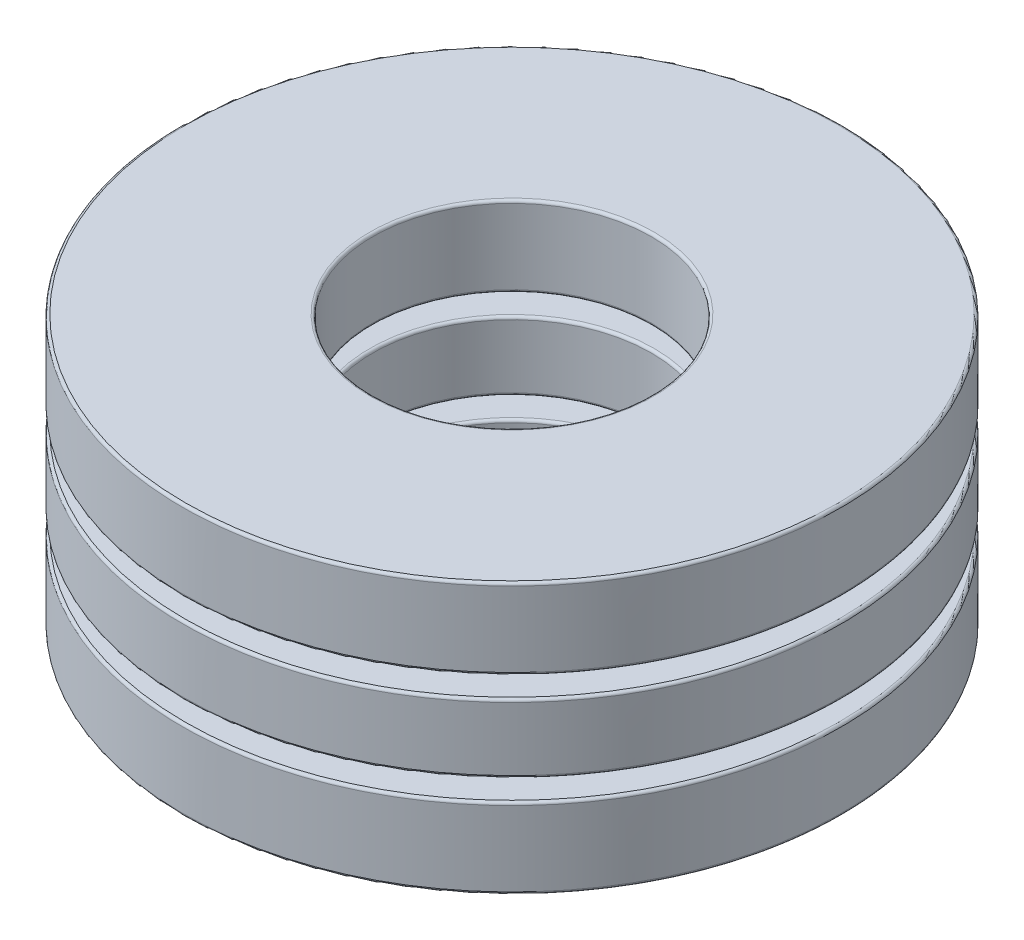
ISO-10303-21;
HEADER;
FILE_DESCRIPTION(('STEP AP214'),'2;1');
FILE_NAME('part.step','',(''),(''),'','','');
FILE_SCHEMA(('AUTOMOTIVE_DESIGN { 1 0 10303 214 1 1 1 1 }'));
ENDSEC;
DATA;
#1=APPLICATION_CONTEXT('core data for automotive mechanical design processes');
#2=APPLICATION_PROTOCOL_DEFINITION('international standard','automotive_design',2000,#1);
#3=PRODUCT_CONTEXT('',#1,'mechanical');
#4=PRODUCT('Part','Part','',(#3));
#5=PRODUCT_RELATED_PRODUCT_CATEGORY('part','',(#4));
#6=PRODUCT_DEFINITION_FORMATION('','',#4);
#7=PRODUCT_DEFINITION_CONTEXT('part definition',#1,'design');
#8=PRODUCT_DEFINITION('design','',#6,#7);
#9=PRODUCT_DEFINITION_SHAPE('','',#8);
#10=(LENGTH_UNIT() NAMED_UNIT(*) SI_UNIT(.MILLI.,.METRE.));
#11=(NAMED_UNIT(*) PLANE_ANGLE_UNIT() SI_UNIT($,.RADIAN.));
#12=(NAMED_UNIT(*) SI_UNIT($,.STERADIAN.) SOLID_ANGLE_UNIT());
#13=UNCERTAINTY_MEASURE_WITH_UNIT(LENGTH_MEASURE(1.E-05),#10,'distance_accuracy_value','');
#14=(GEOMETRIC_REPRESENTATION_CONTEXT(3) GLOBAL_UNCERTAINTY_ASSIGNED_CONTEXT((#13)) GLOBAL_UNIT_ASSIGNED_CONTEXT((#10,
#11,#12)) REPRESENTATION_CONTEXT('',''));
#15=CARTESIAN_POINT('',(0.,0.,0.));
#16=DIRECTION('',(0.,0.,1.));
#17=DIRECTION('',(1.,0.,0.));
#18=AXIS2_PLACEMENT_3D('',#15,#16,#17);
#19=CARTESIAN_POINT('',(0.,-2.46000000000002,0.));
#20=DIRECTION('',(0.,-1.,0.));
#21=DIRECTION('',(0.,0.,-1.));
#22=AXIS2_PLACEMENT_3D('',#19,#20,#21);
#23=CYLINDRICAL_SURFACE('',#22,6.);
#24=CARTESIAN_POINT('',(0.,-2.41079999999999,0.));
#25=DIRECTION('',(0.,1.,0.));
#26=DIRECTION('',(0.,0.,1.));
#27=AXIS2_PLACEMENT_3D('',#24,#25,#26);
#28=CIRCLE('',#27,6.);
#29=CARTESIAN_POINT('',(0.,-2.41079999999999,6.00000000000001));
#30=VERTEX_POINT('',#29);
#31=EDGE_CURVE('E11',#30,#30,#28,.T.);
#32=ORIENTED_EDGE('',*,*,#31,.T.);
#33=EDGE_LOOP('',(#32));
#34=FACE_BOUND('',#33,.T.);
#35=CARTESIAN_POINT('',(0.,-1.04919999999997,0.));
#36=DIRECTION('',(0.,-1.,0.));
#37=DIRECTION('',(0.,0.,-1.));
#38=AXIS2_PLACEMENT_3D('',#35,#36,#37);
#39=CIRCLE('',#38,6.);
#40=CARTESIAN_POINT('',(0.,-1.04919999999997,-6.00000000000001));
#41=VERTEX_POINT('',#40);
#42=EDGE_CURVE('E52',#41,#41,#39,.T.);
#43=ORIENTED_EDGE('',*,*,#42,.T.);
#44=EDGE_LOOP('',(#43));
#45=FACE_BOUND('',#44,.T.);
#46=ADVANCED_FACE('F45',(#34,#45),#23,.T.);
#47=CARTESIAN_POINT('',(2.22044604925031E-13,-1.00000000000011,6.00000000000012));
#48=DIRECTION('',(0.,-1.,0.));
#49=DIRECTION('',(0.,0.,-1.));
#50=AXIS2_PLACEMENT_3D('',#47,#48,#49);
#51=PLANE('',#50);
#52=CARTESIAN_POINT('',(0.,-1.,0.));
#53=DIRECTION('',(0.,-1.,0.));
#54=DIRECTION('',(0.,0.,-1.));
#55=AXIS2_PLACEMENT_3D('',#52,#53,#54);
#56=CIRCLE('',#55,2.5872);
#57=CARTESIAN_POINT('',(0.,-1.,-2.5872));
#58=VERTEX_POINT('',#57);
#59=EDGE_CURVE('E56',#58,#58,#56,.T.);
#60=ORIENTED_EDGE('',*,*,#59,.T.);
#61=EDGE_LOOP('',(#60));
#62=FACE_BOUND('',#61,.T.);
#63=CARTESIAN_POINT('',(0.,-1.,0.));
#64=DIRECTION('',(0.,-1.,0.));
#65=DIRECTION('',(0.,0.,-1.));
#66=AXIS2_PLACEMENT_3D('',#63,#64,#65);
#67=CIRCLE('',#66,5.9508);
#68=CARTESIAN_POINT('',(0.,-1.,-5.95080000000001));
#69=VERTEX_POINT('',#68);
#70=EDGE_CURVE('E60',#69,#69,#67,.F.);
#71=ORIENTED_EDGE('',*,*,#70,.T.);
#72=EDGE_LOOP('',(#71));
#73=FACE_BOUND('',#72,.T.);
#74=ADVANCED_FACE('F88',(#62,#73),#51,.F.);
#75=CARTESIAN_POINT('',(0.,-2.46000000000002,0.));
#76=DIRECTION('',(0.,-1.,0.));
#77=DIRECTION('',(0.,0.,-1.));
#78=AXIS2_PLACEMENT_3D('',#75,#76,#77);
#79=CYLINDRICAL_SURFACE('',#78,2.538);
#80=CARTESIAN_POINT('',(0.,-2.41079999999999,0.));
#81=DIRECTION('',(0.,1.,0.));
#82=DIRECTION('',(0.,0.,1.));
#83=AXIS2_PLACEMENT_3D('',#80,#81,#82);
#84=CIRCLE('',#83,2.538);
#85=CARTESIAN_POINT('',(0.,-2.41079999999999,2.538));
#86=VERTEX_POINT('',#85);
#87=EDGE_CURVE('E71',#86,#86,#84,.F.);
#88=ORIENTED_EDGE('',*,*,#87,.T.);
#89=EDGE_LOOP('',(#88));
#90=FACE_BOUND('',#89,.T.);
#91=CARTESIAN_POINT('',(0.,-1.04919999999997,0.));
#92=DIRECTION('',(0.,-1.,0.));
#93=DIRECTION('',(0.,0.,-1.));
#94=AXIS2_PLACEMENT_3D('',#91,#92,#93);
#95=CIRCLE('',#94,2.538);
#96=CARTESIAN_POINT('',(0.,-1.04919999999997,-2.538));
#97=VERTEX_POINT('',#96);
#98=EDGE_CURVE('E74',#97,#97,#95,.F.);
#99=ORIENTED_EDGE('',*,*,#98,.T.);
#100=EDGE_LOOP('',(#99));
#101=FACE_BOUND('',#100,.T.);
#102=ADVANCED_FACE('F78',(#90,#101),#79,.F.);
#103=CARTESIAN_POINT('',(1.66533453693773E-13,-2.46000000000013,6.00000000000012));
#104=DIRECTION('',(0.,1.,0.));
#105=DIRECTION('',(0.,0.,1.));
#106=AXIS2_PLACEMENT_3D('',#103,#104,#105);
#107=PLANE('',#106);
#108=CARTESIAN_POINT('',(0.,-2.46000000000002,0.));
#109=DIRECTION('',(0.,1.,0.));
#110=DIRECTION('',(0.,0.,1.));
#111=AXIS2_PLACEMENT_3D('',#108,#109,#110);
#112=CIRCLE('',#111,2.5872);
#113=CARTESIAN_POINT('',(0.,-2.46000000000002,2.5872));
#114=VERTEX_POINT('',#113);
#115=EDGE_CURVE('E65',#114,#114,#112,.T.);
#116=ORIENTED_EDGE('',*,*,#115,.T.);
#117=EDGE_LOOP('',(#116));
#118=FACE_BOUND('',#117,.T.);
#119=CARTESIAN_POINT('',(0.,-2.46000000000002,0.));
#120=DIRECTION('',(0.,1.,0.));
#121=DIRECTION('',(0.,0.,1.));
#122=AXIS2_PLACEMENT_3D('',#119,#120,#121);
#123=CIRCLE('',#122,5.9508);
#124=CARTESIAN_POINT('',(0.,-2.46000000000002,5.95080000000001));
#125=VERTEX_POINT('',#124);
#126=EDGE_CURVE('E68',#125,#125,#123,.F.);
#127=ORIENTED_EDGE('',*,*,#126,.T.);
#128=EDGE_LOOP('',(#127));
#129=FACE_BOUND('',#128,.T.);
#130=ADVANCED_FACE('F107',(#118,#129),#107,.F.);
#131=CARTESIAN_POINT('',(0.,-2.41079999999999,0.));
#132=DIRECTION('',(0.,1.,0.));
#133=DIRECTION('',(0.,0.,1.));
#134=AXIS2_PLACEMENT_3D('',#131,#132,#133);
#135=TOROIDAL_SURFACE('',#134,2.5872,0.0492);
#136=ORIENTED_EDGE('',*,*,#115,.F.);
#137=EDGE_LOOP('',(#136));
#138=FACE_BOUND('',#137,.T.);
#139=ORIENTED_EDGE('',*,*,#87,.F.);
#140=EDGE_LOOP('',(#139));
#141=FACE_BOUND('',#140,.T.);
#142=ADVANCED_FACE('F84',(#138,#141),#135,.T.);
#143=CARTESIAN_POINT('',(0.,-1.04919999999997,0.));
#144=DIRECTION('',(0.,-1.,0.));
#145=DIRECTION('',(0.,0.,-1.));
#146=AXIS2_PLACEMENT_3D('',#143,#144,#145);
#147=TOROIDAL_SURFACE('',#146,2.5872,0.0492);
#148=ORIENTED_EDGE('',*,*,#98,.F.);
#149=EDGE_LOOP('',(#148));
#150=FACE_BOUND('',#149,.T.);
#151=ORIENTED_EDGE('',*,*,#59,.F.);
#152=EDGE_LOOP('',(#151));
#153=FACE_BOUND('',#152,.T.);
#154=ADVANCED_FACE('F80',(#150,#153),#147,.T.);
#155=CARTESIAN_POINT('',(0.,-2.41079999999999,0.));
#156=DIRECTION('',(0.,1.,0.));
#157=DIRECTION('',(0.,0.,1.));
#158=AXIS2_PLACEMENT_3D('',#155,#156,#157);
#159=TOROIDAL_SURFACE('',#158,5.9508,0.0492);
#160=ORIENTED_EDGE('',*,*,#31,.F.);
#161=EDGE_LOOP('',(#160));
#162=FACE_BOUND('',#161,.T.);
#163=ORIENTED_EDGE('',*,*,#126,.F.);
#164=EDGE_LOOP('',(#163));
#165=FACE_BOUND('',#164,.T.);
#166=ADVANCED_FACE('F83',(#162,#165),#159,.T.);
#167=CARTESIAN_POINT('',(0.,-1.04919999999997,0.));
#168=DIRECTION('',(0.,-1.,0.));
#169=DIRECTION('',(0.,0.,-1.));
#170=AXIS2_PLACEMENT_3D('',#167,#168,#169);
#171=TOROIDAL_SURFACE('',#170,5.9508,0.0492);
#172=ORIENTED_EDGE('',*,*,#70,.F.);
#173=EDGE_LOOP('',(#172));
#174=FACE_BOUND('',#173,.T.);
#175=ORIENTED_EDGE('',*,*,#42,.F.);
#176=EDGE_LOOP('',(#175));
#177=FACE_BOUND('',#176,.T.);
#178=ADVANCED_FACE('F47',(#174,#177),#171,.T.);
#179=CLOSED_SHELL('',(#46,#74,#102,#130,#142,#154,#166,#178));
#180=MANIFOLD_SOLID_BREP('B2',#179);
#181=CARTESIAN_POINT('',(0.,-2.46000000000002,0.));
#182=DIRECTION('',(0.,-1.,0.));
#183=DIRECTION('',(0.,0.,-1.));
#184=AXIS2_PLACEMENT_3D('',#181,#182,#183);
#185=CYLINDRICAL_SURFACE('',#184,6.);
#186=CARTESIAN_POINT('',(0.,1.04920000000003,0.));
#187=DIRECTION('',(0.,1.,0.));
#188=DIRECTION('',(0.,0.,1.));
#189=AXIS2_PLACEMENT_3D('',#186,#187,#188);
#190=CIRCLE('',#189,6.);
#191=CARTESIAN_POINT('',(0.,1.04920000000003,6.00000000000001));
#192=VERTEX_POINT('',#191);
#193=EDGE_CURVE('E44',#192,#192,#190,.T.);
#194=ORIENTED_EDGE('',*,*,#193,.T.);
#195=EDGE_LOOP('',(#194));
#196=FACE_BOUND('',#195,.T.);
#197=CARTESIAN_POINT('',(0.,2.41079999999999,-2.22044604925031E-13));
#198=DIRECTION('',(0.,-1.,0.));
#199=DIRECTION('',(0.,0.,-1.));
#200=AXIS2_PLACEMENT_3D('',#197,#198,#199);
#201=CIRCLE('',#200,6.);
#202=CARTESIAN_POINT('',(0.,2.41079999999999,-6.00000000000023));
#203=VERTEX_POINT('',#202);
#204=EDGE_CURVE('E179',#203,#203,#201,.T.);
#205=ORIENTED_EDGE('',*,*,#204,.T.);
#206=EDGE_LOOP('',(#205));
#207=FACE_BOUND('',#206,.T.);
#208=ADVANCED_FACE('F172',(#196,#207),#185,.T.);
#209=CARTESIAN_POINT('',(-1.66533453693773E-13,2.45999999999991,5.99999999999978));
#210=DIRECTION('',(0.,-1.,0.));
#211=DIRECTION('',(0.,0.,-1.));
#212=AXIS2_PLACEMENT_3D('',#209,#210,#211);
#213=PLANE('',#212);
#214=CARTESIAN_POINT('',(0.,2.46000000000002,-2.22044604925031E-13));
#215=DIRECTION('',(0.,-1.,0.));
#216=DIRECTION('',(0.,0.,-1.));
#217=AXIS2_PLACEMENT_3D('',#214,#215,#216);
#218=CIRCLE('',#217,2.5872);
#219=CARTESIAN_POINT('',(0.,2.46000000000002,-2.58720000000023));
#220=VERTEX_POINT('',#219);
#221=EDGE_CURVE('E183',#220,#220,#218,.T.);
#222=ORIENTED_EDGE('',*,*,#221,.T.);
#223=EDGE_LOOP('',(#222));
#224=FACE_BOUND('',#223,.T.);
#225=CARTESIAN_POINT('',(0.,2.46000000000002,-2.22044604925031E-13));
#226=DIRECTION('',(0.,-1.,0.));
#227=DIRECTION('',(0.,0.,-1.));
#228=AXIS2_PLACEMENT_3D('',#225,#226,#227);
#229=CIRCLE('',#228,5.9508);
#230=CARTESIAN_POINT('',(0.,2.46000000000002,-5.95080000000023));
#231=VERTEX_POINT('',#230);
#232=EDGE_CURVE('E187',#231,#231,#229,.F.);
#233=ORIENTED_EDGE('',*,*,#232,.T.);
#234=EDGE_LOOP('',(#233));
#235=FACE_BOUND('',#234,.T.);
#236=ADVANCED_FACE('F215',(#224,#235),#213,.F.);
#237=CARTESIAN_POINT('',(0.,-2.46000000000002,0.));
#238=DIRECTION('',(0.,-1.,0.));
#239=DIRECTION('',(0.,0.,-1.));
#240=AXIS2_PLACEMENT_3D('',#237,#238,#239);
#241=CYLINDRICAL_SURFACE('',#240,2.538);
#242=CARTESIAN_POINT('',(0.,1.04920000000003,0.));
#243=DIRECTION('',(0.,1.,0.));
#244=DIRECTION('',(0.,0.,1.));
#245=AXIS2_PLACEMENT_3D('',#242,#243,#244);
#246=CIRCLE('',#245,2.538);
#247=CARTESIAN_POINT('',(0.,1.04920000000003,2.538));
#248=VERTEX_POINT('',#247);
#249=EDGE_CURVE('E198',#248,#248,#246,.F.);
#250=ORIENTED_EDGE('',*,*,#249,.T.);
#251=EDGE_LOOP('',(#250));
#252=FACE_BOUND('',#251,.T.);
#253=CARTESIAN_POINT('',(0.,2.41079999999999,-2.22044604925031E-13));
#254=DIRECTION('',(0.,-1.,0.));
#255=DIRECTION('',(0.,0.,-1.));
#256=AXIS2_PLACEMENT_3D('',#253,#254,#255);
#257=CIRCLE('',#256,2.538);
#258=CARTESIAN_POINT('',(0.,2.41079999999999,-2.53800000000023));
#259=VERTEX_POINT('',#258);
#260=EDGE_CURVE('E201',#259,#259,#257,.F.);
#261=ORIENTED_EDGE('',*,*,#260,.T.);
#262=EDGE_LOOP('',(#261));
#263=FACE_BOUND('',#262,.T.);
#264=ADVANCED_FACE('F205',(#252,#263),#241,.F.);
#265=CARTESIAN_POINT('',(1.11022302462516E-13,0.99999999999989,6.00000000000023));
#266=DIRECTION('',(0.,1.,0.));
#267=DIRECTION('',(0.,0.,1.));
#268=AXIS2_PLACEMENT_3D('',#265,#266,#267);
#269=PLANE('',#268);
#270=CARTESIAN_POINT('',(0.,1.,0.));
#271=DIRECTION('',(0.,1.,0.));
#272=DIRECTION('',(0.,0.,1.));
#273=AXIS2_PLACEMENT_3D('',#270,#271,#272);
#274=CIRCLE('',#273,2.5872);
#275=CARTESIAN_POINT('',(0.,1.,2.5872));
#276=VERTEX_POINT('',#275);
#277=EDGE_CURVE('E192',#276,#276,#274,.T.);
#278=ORIENTED_EDGE('',*,*,#277,.T.);
#279=EDGE_LOOP('',(#278));
#280=FACE_BOUND('',#279,.T.);
#281=CARTESIAN_POINT('',(0.,1.,0.));
#282=DIRECTION('',(0.,1.,0.));
#283=DIRECTION('',(0.,0.,1.));
#284=AXIS2_PLACEMENT_3D('',#281,#282,#283);
#285=CIRCLE('',#284,5.9508);
#286=CARTESIAN_POINT('',(0.,1.,5.95080000000001));
#287=VERTEX_POINT('',#286);
#288=EDGE_CURVE('E195',#287,#287,#285,.F.);
#289=ORIENTED_EDGE('',*,*,#288,.T.);
#290=EDGE_LOOP('',(#289));
#291=FACE_BOUND('',#290,.T.);
#292=ADVANCED_FACE('F234',(#280,#291),#269,.F.);
#293=CARTESIAN_POINT('',(0.,1.04920000000003,0.));
#294=DIRECTION('',(0.,1.,0.));
#295=DIRECTION('',(0.,0.,1.));
#296=AXIS2_PLACEMENT_3D('',#293,#294,#295);
#297=TOROIDAL_SURFACE('',#296,2.5872,0.0492);
#298=ORIENTED_EDGE('',*,*,#277,.F.);
#299=EDGE_LOOP('',(#298));
#300=FACE_BOUND('',#299,.T.);
#301=ORIENTED_EDGE('',*,*,#249,.F.);
#302=EDGE_LOOP('',(#301));
#303=FACE_BOUND('',#302,.T.);
#304=ADVANCED_FACE('F211',(#300,#303),#297,.T.);
#305=CARTESIAN_POINT('',(0.,2.41079999999999,-2.22044604925031E-13));
#306=DIRECTION('',(0.,-1.,0.));
#307=DIRECTION('',(0.,0.,-1.));
#308=AXIS2_PLACEMENT_3D('',#305,#306,#307);
#309=TOROIDAL_SURFACE('',#308,2.5872,0.0492);
#310=ORIENTED_EDGE('',*,*,#260,.F.);
#311=EDGE_LOOP('',(#310));
#312=FACE_BOUND('',#311,.T.);
#313=ORIENTED_EDGE('',*,*,#221,.F.);
#314=EDGE_LOOP('',(#313));
#315=FACE_BOUND('',#314,.T.);
#316=ADVANCED_FACE('F207',(#312,#315),#309,.T.);
#317=CARTESIAN_POINT('',(0.,1.04920000000003,0.));
#318=DIRECTION('',(0.,1.,0.));
#319=DIRECTION('',(0.,0.,1.));
#320=AXIS2_PLACEMENT_3D('',#317,#318,#319);
#321=TOROIDAL_SURFACE('',#320,5.9508,0.0492);
#322=ORIENTED_EDGE('',*,*,#193,.F.);
#323=EDGE_LOOP('',(#322));
#324=FACE_BOUND('',#323,.T.);
#325=ORIENTED_EDGE('',*,*,#288,.F.);
#326=EDGE_LOOP('',(#325));
#327=FACE_BOUND('',#326,.T.);
#328=ADVANCED_FACE('F210',(#324,#327),#321,.T.);
#329=CARTESIAN_POINT('',(0.,2.41079999999999,-2.22044604925031E-13));
#330=DIRECTION('',(0.,-1.,0.));
#331=DIRECTION('',(0.,0.,-1.));
#332=AXIS2_PLACEMENT_3D('',#329,#330,#331);
#333=TOROIDAL_SURFACE('',#332,5.9508,0.0492);
#334=ORIENTED_EDGE('',*,*,#232,.F.);
#335=EDGE_LOOP('',(#334));
#336=FACE_BOUND('',#335,.T.);
#337=ORIENTED_EDGE('',*,*,#204,.F.);
#338=EDGE_LOOP('',(#337));
#339=FACE_BOUND('',#338,.T.);
#340=ADVANCED_FACE('F174',(#336,#339),#333,.T.);
#341=CLOSED_SHELL('',(#208,#236,#264,#292,#304,#316,#328,#340));
#342=MANIFOLD_SOLID_BREP('B6',#341);
#343=CARTESIAN_POINT('',(-3.51824167110602,-1.11022302462516E-13,2.80570410836445));
#344=DIRECTION('',(0.,1.,0.));
#345=DIRECTION('',(0.781831482468023,0.,-0.623489801858743));
#346=AXIS2_PLACEMENT_3D('',#343,#344,#345);
#347=SPHERICAL_SURFACE('',#346,1.);
#348=CARTESIAN_POINT('',(-3.51824167110602,0.999999999999889,2.80570410836445));
#349=VERTEX_POINT('',#348);
#350=VERTEX_LOOP('',#349);
#351=FACE_BOUND('',#350,.T.);
#352=ADVANCED_FACE('F299',(#351),#347,.T.);
#353=CLOSED_SHELL('',(#352));
#354=MANIFOLD_SOLID_BREP('B39',#353);
#355=CARTESIAN_POINT('',(-4.38717560481816,-1.11022302462516E-13,-1.00134420280357));
#356=DIRECTION('',(0.,1.,0.));
#357=DIRECTION('',(0.974927912181827,0.,0.222520933956306));
#358=AXIS2_PLACEMENT_3D('',#355,#356,#357);
#359=SPHERICAL_SURFACE('',#358,1.);
#360=CARTESIAN_POINT('',(-4.38717560481816,0.999999999999889,-1.00134420280357));
#361=VERTEX_POINT('',#360);
#362=VERTEX_LOOP('',#361);
#363=FACE_BOUND('',#362,.T.);
#364=ADVANCED_FACE('F317',(#363),#359,.T.);
#365=CLOSED_SHELL('',(#364));
#366=MANIFOLD_SOLID_BREP('B168',#365);
#367=CARTESIAN_POINT('',(-1.95247682602906,-1.11022302462516E-13,-4.05435990556102));
#368=DIRECTION('',(0.,1.,0.));
#369=DIRECTION('',(0.433883739117565,0.,0.900968867902417));
#370=AXIS2_PLACEMENT_3D('',#367,#368,#369);
#371=SPHERICAL_SURFACE('',#370,1.);
#372=CARTESIAN_POINT('',(-1.95247682602906,0.999999999999889,-4.05435990556102));
#373=VERTEX_POINT('',#372);
#374=VERTEX_LOOP('',#373);
#375=FACE_BOUND('',#374,.T.);
#376=ADVANCED_FACE('F335',(#375),#371,.T.);
#377=CLOSED_SHELL('',(#376));
#378=MANIFOLD_SOLID_BREP('B295',#377);
#379=CARTESIAN_POINT('',(1.95247682602911,0.,-4.05435990556102));
#380=DIRECTION('',(0.,1.,0.));
#381=DIRECTION('',(-0.433883739117553,0.,0.900968867902423));
#382=AXIS2_PLACEMENT_3D('',#379,#380,#381);
#383=SPHERICAL_SURFACE('',#382,1.);
#384=CARTESIAN_POINT('',(1.95247682602911,1.,-4.05435990556102));
#385=VERTEX_POINT('',#384);
#386=VERTEX_LOOP('',#385);
#387=FACE_BOUND('',#386,.T.);
#388=ADVANCED_FACE('F353',(#387),#383,.T.);
#389=CLOSED_SHELL('',(#388));
#390=MANIFOLD_SOLID_BREP('B313',#389);
#391=CARTESIAN_POINT('',(4.38717560481824,0.,-1.00134420280368));
#392=DIRECTION('',(0.,1.,0.));
#393=DIRECTION('',(-0.974927912181824,0.,0.222520933956318));
#394=AXIS2_PLACEMENT_3D('',#391,#392,#393);
#395=SPHERICAL_SURFACE('',#394,1.);
#396=CARTESIAN_POINT('',(4.38717560481824,1.,-1.00134420280368));
#397=VERTEX_POINT('',#396);
#398=VERTEX_LOOP('',#397);
#399=FACE_BOUND('',#398,.T.);
#400=ADVANCED_FACE('F371',(#399),#395,.T.);
#401=CLOSED_SHELL('',(#400));
#402=MANIFOLD_SOLID_BREP('B331',#401);
#403=CARTESIAN_POINT('',(3.51824167110627,0.,2.80570410836367));
#404=DIRECTION('',(0.,1.,0.));
#405=DIRECTION('',(-0.781831482468032,0.,-0.623489801858733));
#406=AXIS2_PLACEMENT_3D('',#403,#404,#405);
#407=SPHERICAL_SURFACE('',#406,1.);
#408=CARTESIAN_POINT('',(3.51824167110627,1.,2.80570410836367));
#409=VERTEX_POINT('',#408);
#410=VERTEX_LOOP('',#409);
#411=FACE_BOUND('',#410,.T.);
#412=ADVANCED_FACE('F389',(#411),#407,.T.);
#413=CLOSED_SHELL('',(#412));
#414=MANIFOLD_SOLID_BREP('B349',#413);
#415=CARTESIAN_POINT('',(0.,0.,4.49999999999939));
#416=DIRECTION('',(0.,1.,0.));
#417=DIRECTION('',(0.,0.,-1.));
#418=AXIS2_PLACEMENT_3D('',#415,#416,#417);
#419=SPHERICAL_SURFACE('',#418,1.);
#420=CARTESIAN_POINT('',(0.,1.,4.49999999999939));
#421=VERTEX_POINT('',#420);
#422=VERTEX_LOOP('',#421);
#423=FACE_BOUND('',#422,.T.);
#424=ADVANCED_FACE('F408',(#423),#419,.T.);
#425=CLOSED_SHELL('',(#424));
#426=MANIFOLD_SOLID_BREP('B367',#425);
#427=CARTESIAN_POINT('',(0.,-2.46000000000002,0.));
#428=DIRECTION('',(0.,-1.,0.));
#429=DIRECTION('',(0.,0.,-1.));
#430=AXIS2_PLACEMENT_3D('',#427,#428,#429);
#431=CYLINDRICAL_SURFACE('',#430,6.);
#432=CARTESIAN_POINT('',(0.,-0.575800000000015,0.));
#433=DIRECTION('',(0.,1.,0.));
#434=DIRECTION('',(0.,0.,1.));
#435=AXIS2_PLACEMENT_3D('',#432,#433,#434);
#436=CIRCLE('',#435,6.);
#437=CARTESIAN_POINT('',(0.,-0.575800000000015,6.00000000000001));
#438=VERTEX_POINT('',#437);
#439=EDGE_CURVE('E407',#438,#438,#436,.T.);
#440=ORIENTED_EDGE('',*,*,#439,.T.);
#441=EDGE_LOOP('',(#440));
#442=FACE_BOUND('',#441,.T.);
#443=CARTESIAN_POINT('',(0.,0.575800000000015,-1.11022302462516E-13));
#444=DIRECTION('',(0.,-1.,0.));
#445=DIRECTION('',(0.,0.,-1.));
#446=AXIS2_PLACEMENT_3D('',#443,#444,#445);
#447=CIRCLE('',#446,6.);
#448=CARTESIAN_POINT('',(0.,0.575800000000015,-6.00000000000012));
#449=VERTEX_POINT('',#448);
#450=EDGE_CURVE('E427',#449,#449,#447,.T.);
#451=ORIENTED_EDGE('',*,*,#450,.T.);
#452=EDGE_LOOP('',(#451));
#453=FACE_BOUND('',#452,.T.);
#454=ADVANCED_FACE('F420',(#442,#453),#431,.T.);
#455=CARTESIAN_POINT('',(1.66533453693773E-13,-0.625000000000098,6.00000000000012));
#456=DIRECTION('',(0.,1.,0.));
#457=DIRECTION('',(0.,0.,1.));
#458=AXIS2_PLACEMENT_3D('',#455,#456,#457);
#459=PLANE('',#458);
#460=CARTESIAN_POINT('',(0.,-0.624999999999987,0.));
#461=DIRECTION('',(0.,1.,0.));
#462=DIRECTION('',(0.,0.,1.));
#463=AXIS2_PLACEMENT_3D('',#460,#461,#462);
#464=CIRCLE('',#463,2.5872);
#465=CARTESIAN_POINT('',(0.,-0.624999999999987,2.5872));
#466=VERTEX_POINT('',#465);
#467=EDGE_CURVE('E440',#466,#466,#464,.T.);
#468=ORIENTED_EDGE('',*,*,#467,.T.);
#469=EDGE_LOOP('',(#468));
#470=FACE_BOUND('',#469,.T.);
#471=CARTESIAN_POINT('',(0.,-0.624999999999987,0.));
#472=DIRECTION('',(0.,1.,0.));
#473=DIRECTION('',(0.,0.,1.));
#474=AXIS2_PLACEMENT_3D('',#471,#472,#473);
#475=CIRCLE('',#474,5.9508);
#476=CARTESIAN_POINT('',(0.,-0.624999999999987,5.95080000000001));
#477=VERTEX_POINT('',#476);
#478=EDGE_CURVE('E443',#477,#477,#475,.F.);
#479=ORIENTED_EDGE('',*,*,#478,.T.);
#480=EDGE_LOOP('',(#479));
#481=FACE_BOUND('',#480,.T.);
#482=CARTESIAN_POINT('',(-3.51824167110604,-0.625000000000098,2.80570410836445));
#483=DIRECTION('',(0.,1.,0.));
#484=DIRECTION('',(-0.781831482468023,0.,0.623489801858743));
#485=AXIS2_PLACEMENT_3D('',#482,#483,#484);
#486=CIRCLE('',#485,0.85923294280422);
#487=CARTESIAN_POINT('',(-4.19001703656402,-0.625000000000098,3.34142708562396));
#488=VERTEX_POINT('',#487);
#489=EDGE_CURVE('E488',#488,#488,#486,.T.);
#490=ORIENTED_EDGE('',*,*,#489,.T.);
#491=EDGE_LOOP('',(#490));
#492=FACE_BOUND('',#491,.T.);
#493=CARTESIAN_POINT('',(-4.38717560481813,-0.625000000000098,-1.00134420280362));
#494=DIRECTION('',(0.,1.,0.));
#495=DIRECTION('',(-0.974927912181827,0.,-0.222520933956305));
#496=AXIS2_PLACEMENT_3D('',#493,#494,#495);
#497=CIRCLE('',#496,0.85923294280422);
#498=CARTESIAN_POINT('',(-5.2248657838241,-0.625000000000098,-1.19254151972244));
#499=VERTEX_POINT('',#498);
#500=EDGE_CURVE('E482',#499,#499,#497,.T.);
#501=ORIENTED_EDGE('',*,*,#500,.T.);
#502=EDGE_LOOP('',(#501));
#503=FACE_BOUND('',#502,.T.);
#504=CARTESIAN_POINT('',(-1.95247682602903,-0.625000000000098,-4.05435990556102));
#505=DIRECTION('',(0.,1.,0.));
#506=DIRECTION('',(-0.433883739117566,0.,-0.900968867902417));
#507=AXIS2_PLACEMENT_3D('',#504,#505,#506);
#508=CIRCLE('',#507,0.85923294280422);
#509=CARTESIAN_POINT('',(-2.32528402802592,-0.625000000000098,-4.8285020373038));
#510=VERTEX_POINT('',#509);
#511=EDGE_CURVE('E476',#510,#510,#508,.T.);
#512=ORIENTED_EDGE('',*,*,#511,.T.);
#513=EDGE_LOOP('',(#512));
#514=FACE_BOUND('',#513,.T.);
#515=CARTESIAN_POINT('',(1.95247682602902,-0.624999999999987,-4.05435990556102));
#516=DIRECTION('',(0.,1.,0.));
#517=DIRECTION('',(0.433883739117553,0.,-0.900968867902423));
#518=AXIS2_PLACEMENT_3D('',#515,#516,#517);
#519=CIRCLE('',#518,0.85923294280422);
#520=CARTESIAN_POINT('',(2.32528402802589,-0.624999999999987,-4.82850203730381));
#521=VERTEX_POINT('',#520);
#522=EDGE_CURVE('E470',#521,#521,#519,.T.);
#523=ORIENTED_EDGE('',*,*,#522,.T.);
#524=EDGE_LOOP('',(#523));
#525=FACE_BOUND('',#524,.T.);
#526=CARTESIAN_POINT('',(4.3871756048182,-0.624999999999987,-1.00134420280373));
#527=DIRECTION('',(0.,1.,0.));
#528=DIRECTION('',(0.974927912181825,0.,-0.222520933956319));
#529=AXIS2_PLACEMENT_3D('',#526,#527,#528);
#530=CIRCLE('',#529,0.85923294280422);
#531=CARTESIAN_POINT('',(5.22486578382417,-0.624999999999987,-1.19254151972256));
#532=VERTEX_POINT('',#531);
#533=EDGE_CURVE('E464',#532,#532,#530,.T.);
#534=ORIENTED_EDGE('',*,*,#533,.T.);
#535=EDGE_LOOP('',(#534));
#536=FACE_BOUND('',#535,.T.);
#537=CARTESIAN_POINT('',(3.51824167110627,-0.624999999999987,2.80570410836367));
#538=DIRECTION('',(0.,1.,0.));
#539=DIRECTION('',(0.781831482468032,0.,0.623489801858733));
#540=AXIS2_PLACEMENT_3D('',#537,#538,#539);
#541=CIRCLE('',#540,0.85923294280422);
#542=CARTESIAN_POINT('',(4.19001703656427,-0.624999999999987,3.34142708562317));
#543=VERTEX_POINT('',#542);
#544=EDGE_CURVE('E456',#543,#543,#541,.T.);
#545=ORIENTED_EDGE('',*,*,#544,.T.);
#546=EDGE_LOOP('',(#545));
#547=FACE_BOUND('',#546,.T.);
#548=CARTESIAN_POINT('',(0.,-0.624999999999987,4.4999999999995));
#549=DIRECTION('',(0.,1.,0.));
#550=DIRECTION('',(0.,0.,1.));
#551=AXIS2_PLACEMENT_3D('',#548,#549,#550);
#552=CIRCLE('',#551,0.85923294280422);
#553=CARTESIAN_POINT('',(0.,-0.624999999999987,5.35923294280373));
#554=VERTEX_POINT('',#553);
#555=EDGE_CURVE('E452',#554,#554,#552,.T.);
#556=ORIENTED_EDGE('',*,*,#555,.T.);
#557=EDGE_LOOP('',(#556));
#558=FACE_BOUND('',#557,.T.);
#559=ADVANCED_FACE('F506',(#470,#481,#492,#503,#514,#525,#536,#547,#558),#459,.F.);
#560=CARTESIAN_POINT('',(0.,-2.46000000000002,0.));
#561=DIRECTION('',(0.,-1.,0.));
#562=DIRECTION('',(0.,0.,-1.));
#563=AXIS2_PLACEMENT_3D('',#560,#561,#562);
#564=CYLINDRICAL_SURFACE('',#563,2.538);
#565=CARTESIAN_POINT('',(0.,-0.575800000000015,0.));
#566=DIRECTION('',(0.,1.,0.));
#567=DIRECTION('',(0.,0.,1.));
#568=AXIS2_PLACEMENT_3D('',#565,#566,#567);
#569=CIRCLE('',#568,2.538);
#570=CARTESIAN_POINT('',(0.,-0.575800000000015,2.538));
#571=VERTEX_POINT('',#570);
#572=EDGE_CURVE('E446',#571,#571,#569,.F.);
#573=ORIENTED_EDGE('',*,*,#572,.T.);
#574=EDGE_LOOP('',(#573));
#575=FACE_BOUND('',#574,.T.);
#576=CARTESIAN_POINT('',(0.,0.575800000000015,-1.11022302462516E-13));
#577=DIRECTION('',(0.,-1.,0.));
#578=DIRECTION('',(0.,0.,-1.));
#579=AXIS2_PLACEMENT_3D('',#576,#577,#578);
#580=CIRCLE('',#579,2.538);
#581=CARTESIAN_POINT('',(0.,0.575800000000015,-2.53800000000011));
#582=VERTEX_POINT('',#581);
#583=EDGE_CURVE('E449',#582,#582,#580,.F.);
#584=ORIENTED_EDGE('',*,*,#583,.T.);
#585=EDGE_LOOP('',(#584));
#586=FACE_BOUND('',#585,.T.);
#587=ADVANCED_FACE('F509',(#575,#586),#564,.F.);
#588=CARTESIAN_POINT('',(1.11022302462516E-13,0.624999999999876,6.00000000000012));
#589=DIRECTION('',(0.,-1.,0.));
#590=DIRECTION('',(0.,0.,-1.));
#591=AXIS2_PLACEMENT_3D('',#588,#589,#590);
#592=PLANE('',#591);
#593=CARTESIAN_POINT('',(0.,0.624999999999987,-1.11022302462516E-13));
#594=DIRECTION('',(0.,-1.,0.));
#595=DIRECTION('',(0.,0.,-1.));
#596=AXIS2_PLACEMENT_3D('',#593,#594,#595);
#597=CIRCLE('',#596,2.5872);
#598=CARTESIAN_POINT('',(0.,0.624999999999987,-2.58720000000011));
#599=VERTEX_POINT('',#598);
#600=EDGE_CURVE('E431',#599,#599,#597,.T.);
#601=ORIENTED_EDGE('',*,*,#600,.T.);
#602=EDGE_LOOP('',(#601));
#603=FACE_BOUND('',#602,.T.);
#604=CARTESIAN_POINT('',(0.,0.624999999999987,-1.11022302462516E-13));
#605=DIRECTION('',(0.,-1.,0.));
#606=DIRECTION('',(0.,0.,-1.));
#607=AXIS2_PLACEMENT_3D('',#604,#605,#606);
#608=CIRCLE('',#607,5.9508);
#609=CARTESIAN_POINT('',(0.,0.624999999999987,-5.95080000000012));
#610=VERTEX_POINT('',#609);
#611=EDGE_CURVE('E435',#610,#610,#608,.F.);
#612=ORIENTED_EDGE('',*,*,#611,.T.);
#613=EDGE_LOOP('',(#612));
#614=FACE_BOUND('',#613,.T.);
#615=CARTESIAN_POINT('',(-3.51824167110609,0.624999999999876,2.80570410836445));
#616=DIRECTION('',(0.,-1.,0.));
#617=DIRECTION('',(0.781831482468023,0.,-0.623489801858743));
#618=AXIS2_PLACEMENT_3D('',#615,#616,#617);
#619=CIRCLE('',#618,0.85923294280422);
#620=CARTESIAN_POINT('',(-2.84646630564811,0.624999999999876,2.26998113110494));
#621=VERTEX_POINT('',#620);
#622=EDGE_CURVE('E491',#621,#621,#619,.T.);
#623=ORIENTED_EDGE('',*,*,#622,.T.);
#624=EDGE_LOOP('',(#623));
#625=FACE_BOUND('',#624,.T.);
#626=CARTESIAN_POINT('',(-4.38717560481824,0.624999999999876,-1.00134420280351));
#627=DIRECTION('',(0.,-1.,0.));
#628=DIRECTION('',(0.974927912181827,0.,0.222520933956305));
#629=AXIS2_PLACEMENT_3D('',#626,#627,#628);
#630=CIRCLE('',#629,0.85923294280422);
#631=CARTESIAN_POINT('',(-3.54948542581228,0.624999999999876,-0.810146885884692));
#632=VERTEX_POINT('',#631);
#633=EDGE_CURVE('E485',#632,#632,#630,.T.);
#634=ORIENTED_EDGE('',*,*,#633,.T.);
#635=EDGE_LOOP('',(#634));
#636=FACE_BOUND('',#635,.T.);
#637=CARTESIAN_POINT('',(-1.95247682602909,0.624999999999876,-4.05435990556102));
#638=DIRECTION('',(0.,-1.,0.));
#639=DIRECTION('',(0.433883739117566,0.,0.900968867902417));
#640=AXIS2_PLACEMENT_3D('',#637,#638,#639);
#641=CIRCLE('',#640,0.85923294280422);
#642=CARTESIAN_POINT('',(-1.5796696240322,0.624999999999876,-3.28021777381824));
#643=VERTEX_POINT('',#642);
#644=EDGE_CURVE('E479',#643,#643,#641,.T.);
#645=ORIENTED_EDGE('',*,*,#644,.T.);
#646=EDGE_LOOP('',(#645));
#647=FACE_BOUND('',#646,.T.);
#648=CARTESIAN_POINT('',(1.95247682602895,0.624999999999987,-4.05435990556091));
#649=DIRECTION('',(0.,-1.,0.));
#650=DIRECTION('',(-0.433883739117553,0.,0.900968867902423));
#651=AXIS2_PLACEMENT_3D('',#648,#649,#650);
#652=CIRCLE('',#651,0.85923294280422);
#653=CARTESIAN_POINT('',(1.57966962403207,0.624999999999987,-3.28021777381813));
#654=VERTEX_POINT('',#653);
#655=EDGE_CURVE('E473',#654,#654,#652,.T.);
#656=ORIENTED_EDGE('',*,*,#655,.T.);
#657=EDGE_LOOP('',(#656));
#658=FACE_BOUND('',#657,.T.);
#659=CARTESIAN_POINT('',(4.38717560481824,0.624999999999987,-1.00134420280373));
#660=DIRECTION('',(0.,-1.,0.));
#661=DIRECTION('',(-0.974927912181825,0.,0.222520933956319));
#662=AXIS2_PLACEMENT_3D('',#659,#660,#661);
#663=CIRCLE('',#662,0.85923294280422);
#664=CARTESIAN_POINT('',(3.54948542581228,0.624999999999987,-0.810146885884902));
#665=VERTEX_POINT('',#664);
#666=EDGE_CURVE('E467',#665,#665,#663,.T.);
#667=ORIENTED_EDGE('',*,*,#666,.T.);
#668=EDGE_LOOP('',(#667));
#669=FACE_BOUND('',#668,.T.);
#670=CARTESIAN_POINT('',(3.51824167110622,0.624999999999987,2.80570410836367));
#671=DIRECTION('',(0.,-1.,0.));
#672=DIRECTION('',(-0.781831482468032,0.,-0.623489801858733));
#673=AXIS2_PLACEMENT_3D('',#670,#671,#672);
#674=CIRCLE('',#673,0.85923294280422);
#675=CARTESIAN_POINT('',(2.84646630564822,0.624999999999987,2.26998113110417));
#676=VERTEX_POINT('',#675);
#677=EDGE_CURVE('E461',#676,#676,#674,.T.);
#678=ORIENTED_EDGE('',*,*,#677,.T.);
#679=EDGE_LOOP('',(#678));
#680=FACE_BOUND('',#679,.T.);
#681=CARTESIAN_POINT('',(0.,0.624999999999987,4.4999999999995));
#682=DIRECTION('',(0.,-1.,0.));
#683=DIRECTION('',(0.,0.,-1.));
#684=AXIS2_PLACEMENT_3D('',#681,#682,#683);
#685=CIRCLE('',#684,0.85923294280422);
#686=CARTESIAN_POINT('',(0.,0.624999999999987,3.64076705719528));
#687=VERTEX_POINT('',#686);
#688=EDGE_CURVE('E453',#687,#687,#685,.T.);
#689=ORIENTED_EDGE('',*,*,#688,.T.);
#690=EDGE_LOOP('',(#689));
#691=FACE_BOUND('',#690,.T.);
#692=ADVANCED_FACE('F495',(#603,#614,#625,#636,#647,#658,#669,#680,#691),#592,.F.);
#693=CARTESIAN_POINT('',(0.,0.,4.49999999999939));
#694=DIRECTION('',(0.,1.,0.));
#695=DIRECTION('',(0.,0.,-1.));
#696=AXIS2_PLACEMENT_3D('',#693,#694,#695);
#697=SPHERICAL_SURFACE('',#696,1.0625);
#698=ORIENTED_EDGE('',*,*,#688,.F.);
#699=EDGE_LOOP('',(#698));
#700=FACE_BOUND('',#699,.T.);
#701=ORIENTED_EDGE('',*,*,#555,.F.);
#702=EDGE_LOOP('',(#701));
#703=FACE_BOUND('',#702,.T.);
#704=ADVANCED_FACE('F524',(#700,#703),#697,.F.);
#705=CARTESIAN_POINT('',(3.51824167110627,0.,2.80570410836367));
#706=DIRECTION('',(0.,1.,0.));
#707=DIRECTION('',(-0.781831482468032,0.,-0.623489801858733));
#708=AXIS2_PLACEMENT_3D('',#705,#706,#707);
#709=SPHERICAL_SURFACE('',#708,1.0625);
#710=ORIENTED_EDGE('',*,*,#677,.F.);
#711=EDGE_LOOP('',(#710));
#712=FACE_BOUND('',#711,.T.);
#713=ORIENTED_EDGE('',*,*,#544,.F.);
#714=EDGE_LOOP('',(#713));
#715=FACE_BOUND('',#714,.T.);
#716=ADVANCED_FACE('F526',(#712,#715),#709,.F.);
#717=CARTESIAN_POINT('',(4.3871756048183,0.,-1.00134420280362));
#718=DIRECTION('',(0.,1.,0.));
#719=DIRECTION('',(-0.974927912181825,0.,0.222520933956319));
#720=AXIS2_PLACEMENT_3D('',#717,#718,#719);
#721=SPHERICAL_SURFACE('',#720,1.0625);
#722=ORIENTED_EDGE('',*,*,#666,.F.);
#723=EDGE_LOOP('',(#722));
#724=FACE_BOUND('',#723,.T.);
#725=ORIENTED_EDGE('',*,*,#533,.F.);
#726=EDGE_LOOP('',(#725));
#727=FACE_BOUND('',#726,.T.);
#728=ADVANCED_FACE('F533',(#724,#727),#721,.F.);
#729=CARTESIAN_POINT('',(1.95247682602907,0.,-4.05435990556113));
#730=DIRECTION('',(0.,1.,0.));
#731=DIRECTION('',(-0.433883739117553,0.,0.900968867902423));
#732=AXIS2_PLACEMENT_3D('',#729,#730,#731);
#733=SPHERICAL_SURFACE('',#732,1.0625);
#734=ORIENTED_EDGE('',*,*,#655,.F.);
#735=EDGE_LOOP('',(#734));
#736=FACE_BOUND('',#735,.T.);
#737=ORIENTED_EDGE('',*,*,#522,.F.);
#738=EDGE_LOOP('',(#737));
#739=FACE_BOUND('',#738,.T.);
#740=ADVANCED_FACE('F607',(#736,#739),#733,.F.);
#741=CARTESIAN_POINT('',(-1.95247682602903,-1.11022302462516E-13,-4.05435990556102));
#742=DIRECTION('',(0.,1.,0.));
#743=DIRECTION('',(0.433883739117566,0.,0.900968867902417));
#744=AXIS2_PLACEMENT_3D('',#741,#742,#743);
#745=SPHERICAL_SURFACE('',#744,1.0625);
#746=ORIENTED_EDGE('',*,*,#644,.F.);
#747=EDGE_LOOP('',(#746));
#748=FACE_BOUND('',#747,.T.);
#749=ORIENTED_EDGE('',*,*,#511,.F.);
#750=EDGE_LOOP('',(#749));
#751=FACE_BOUND('',#750,.T.);
#752=ADVANCED_FACE('F597',(#748,#751),#745,.F.);
#753=CARTESIAN_POINT('',(-4.38717560481813,-1.11022302462516E-13,-1.00134420280362));
#754=DIRECTION('',(0.,1.,0.));
#755=DIRECTION('',(0.974927912181827,0.,0.222520933956305));
#756=AXIS2_PLACEMENT_3D('',#753,#754,#755);
#757=SPHERICAL_SURFACE('',#756,1.0625);
#758=ORIENTED_EDGE('',*,*,#633,.F.);
#759=EDGE_LOOP('',(#758));
#760=FACE_BOUND('',#759,.T.);
#761=ORIENTED_EDGE('',*,*,#500,.F.);
#762=EDGE_LOOP('',(#761));
#763=FACE_BOUND('',#762,.T.);
#764=ADVANCED_FACE('F502',(#760,#763),#757,.F.);
#765=CARTESIAN_POINT('',(-3.51824167110604,-1.11022302462516E-13,2.80570410836445));
#766=DIRECTION('',(0.,1.,0.));
#767=DIRECTION('',(0.781831482468023,0.,-0.623489801858743));
#768=AXIS2_PLACEMENT_3D('',#765,#766,#767);
#769=SPHERICAL_SURFACE('',#768,1.0625);
#770=ORIENTED_EDGE('',*,*,#622,.F.);
#771=EDGE_LOOP('',(#770));
#772=FACE_BOUND('',#771,.T.);
#773=ORIENTED_EDGE('',*,*,#489,.F.);
#774=EDGE_LOOP('',(#773));
#775=FACE_BOUND('',#774,.T.);
#776=ADVANCED_FACE('F498',(#772,#775),#769,.F.);
#777=CARTESIAN_POINT('',(0.,-0.575800000000015,0.));
#778=DIRECTION('',(0.,1.,0.));
#779=DIRECTION('',(0.,0.,1.));
#780=AXIS2_PLACEMENT_3D('',#777,#778,#779);
#781=TOROIDAL_SURFACE('',#780,2.5872,0.0492);
#782=ORIENTED_EDGE('',*,*,#467,.F.);
#783=EDGE_LOOP('',(#782));
#784=FACE_BOUND('',#783,.T.);
#785=ORIENTED_EDGE('',*,*,#572,.F.);
#786=EDGE_LOOP('',(#785));
#787=FACE_BOUND('',#786,.T.);
#788=ADVANCED_FACE('F501',(#784,#787),#781,.T.);
#789=CARTESIAN_POINT('',(0.,0.575800000000015,-1.11022302462516E-13));
#790=DIRECTION('',(0.,-1.,0.));
#791=DIRECTION('',(0.,0.,-1.));
#792=AXIS2_PLACEMENT_3D('',#789,#790,#791);
#793=TOROIDAL_SURFACE('',#792,2.5872,0.0492);
#794=ORIENTED_EDGE('',*,*,#583,.F.);
#795=EDGE_LOOP('',(#794));
#796=FACE_BOUND('',#795,.T.);
#797=ORIENTED_EDGE('',*,*,#600,.F.);
#798=EDGE_LOOP('',(#797));
#799=FACE_BOUND('',#798,.T.);
#800=ADVANCED_FACE('F547',(#796,#799),#793,.T.);
#801=CARTESIAN_POINT('',(0.,-0.575800000000015,0.));
#802=DIRECTION('',(0.,1.,0.));
#803=DIRECTION('',(0.,0.,1.));
#804=AXIS2_PLACEMENT_3D('',#801,#802,#803);
#805=TOROIDAL_SURFACE('',#804,5.9508,0.0492);
#806=ORIENTED_EDGE('',*,*,#439,.F.);
#807=EDGE_LOOP('',(#806));
#808=FACE_BOUND('',#807,.T.);
#809=ORIENTED_EDGE('',*,*,#478,.F.);
#810=EDGE_LOOP('',(#809));
#811=FACE_BOUND('',#810,.T.);
#812=ADVANCED_FACE('F550',(#808,#811),#805,.T.);
#813=CARTESIAN_POINT('',(0.,0.575800000000015,-1.11022302462516E-13));
#814=DIRECTION('',(0.,-1.,0.));
#815=DIRECTION('',(0.,0.,-1.));
#816=AXIS2_PLACEMENT_3D('',#813,#814,#815);
#817=TOROIDAL_SURFACE('',#816,5.9508,0.0492);
#818=ORIENTED_EDGE('',*,*,#611,.F.);
#819=EDGE_LOOP('',(#818));
#820=FACE_BOUND('',#819,.T.);
#821=ORIENTED_EDGE('',*,*,#450,.F.);
#822=EDGE_LOOP('',(#821));
#823=FACE_BOUND('',#822,.T.);
#824=ADVANCED_FACE('F422',(#820,#823),#817,.T.);
#825=CLOSED_SHELL('',(#454,#559,#587,#692,#704,#716,#728,#740,#752,#764,#776,#788,#800,#812,#824));
#826=MANIFOLD_SOLID_BREP('B385',#825);
#827=ADVANCED_BREP_SHAPE_REPRESENTATION('',(#18,#180,#342,#354,#366,#378,#390,#402,#414,#426,
#826),#14);
#828=SHAPE_DEFINITION_REPRESENTATION(#9,#827);
ENDSEC;
END-ISO-10303-21;
